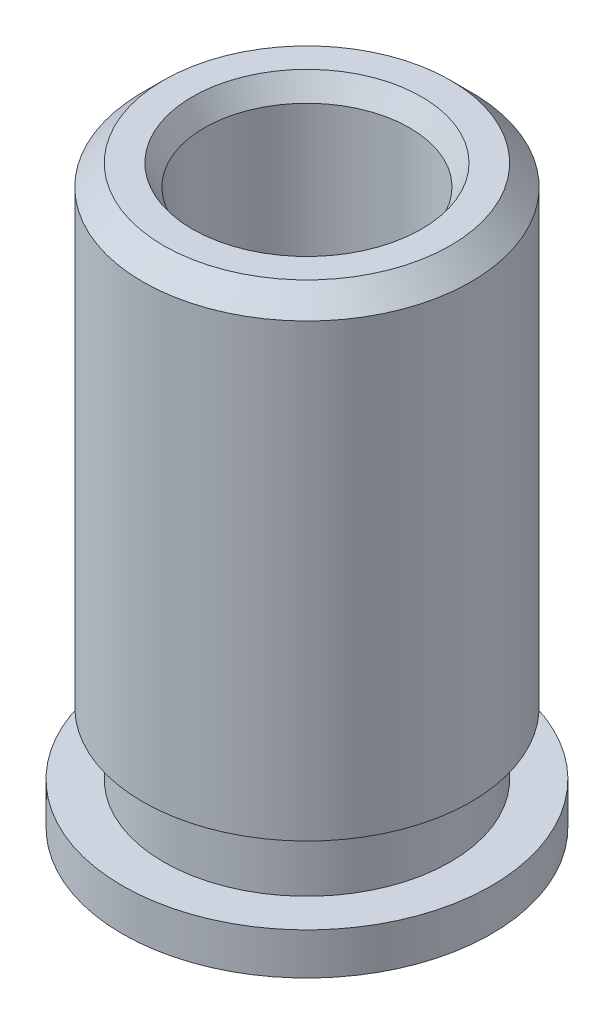
ISO-10303-21;
HEADER;
FILE_DESCRIPTION(('STEP AP214'),'2;1');
FILE_NAME('part.step','',(''),(''),'','','');
FILE_SCHEMA(('AUTOMOTIVE_DESIGN { 1 0 10303 214 1 1 1 1 }'));
ENDSEC;
DATA;
#1=APPLICATION_CONTEXT('core data for automotive mechanical design processes');
#2=APPLICATION_PROTOCOL_DEFINITION('international standard','automotive_design',2000,#1);
#3=PRODUCT_CONTEXT('',#1,'mechanical');
#4=PRODUCT('Part','Part','',(#3));
#5=PRODUCT_RELATED_PRODUCT_CATEGORY('part','',(#4));
#6=PRODUCT_DEFINITION_FORMATION('','',#4);
#7=PRODUCT_DEFINITION_CONTEXT('part definition',#1,'design');
#8=PRODUCT_DEFINITION('design','',#6,#7);
#9=PRODUCT_DEFINITION_SHAPE('','',#8);
#10=(LENGTH_UNIT() NAMED_UNIT(*) SI_UNIT(.MILLI.,.METRE.));
#11=(NAMED_UNIT(*) PLANE_ANGLE_UNIT() SI_UNIT($,.RADIAN.));
#12=(NAMED_UNIT(*) SI_UNIT($,.STERADIAN.) SOLID_ANGLE_UNIT());
#13=UNCERTAINTY_MEASURE_WITH_UNIT(LENGTH_MEASURE(1.E-05),#10,'distance_accuracy_value','');
#14=(GEOMETRIC_REPRESENTATION_CONTEXT(3) GLOBAL_UNCERTAINTY_ASSIGNED_CONTEXT((#13)) GLOBAL_UNIT_ASSIGNED_CONTEXT((#10,
#11,#12)) REPRESENTATION_CONTEXT('',''));
#15=CARTESIAN_POINT('',(0.,0.,0.));
#16=DIRECTION('',(0.,0.,1.));
#17=DIRECTION('',(1.,0.,0.));
#18=AXIS2_PLACEMENT_3D('',#15,#16,#17);
#19=CARTESIAN_POINT('',(0.,3.5052,0.));
#20=DIRECTION('',(0.,1.,0.));
#21=DIRECTION('',(0.,0.,1.));
#22=AXIS2_PLACEMENT_3D('',#19,#20,#21);
#23=CYLINDRICAL_SURFACE('',#22,2.2479);
#24=CARTESIAN_POINT('',(0.,-3.5052,0.));
#25=DIRECTION('',(0.,1.,0.));
#26=DIRECTION('',(0.,0.,1.));
#27=AXIS2_PLACEMENT_3D('',#24,#25,#26);
#28=CIRCLE('',#27,2.2479);
#29=CARTESIAN_POINT('',(0.,-3.5052,2.2479));
#30=VERTEX_POINT('',#29);
#31=EDGE_CURVE('E51',#30,#30,#28,.T.);
#32=ORIENTED_EDGE('',*,*,#31,.T.);
#33=EDGE_LOOP('',(#32));
#34=FACE_BOUND('',#33,.T.);
#35=CARTESIAN_POINT('',(0.,-2.9972,0.));
#36=DIRECTION('',(0.,1.,0.));
#37=DIRECTION('',(0.,0.,1.));
#38=AXIS2_PLACEMENT_3D('',#35,#36,#37);
#39=CIRCLE('',#38,2.2479);
#40=CARTESIAN_POINT('',(0.,-2.9972,2.2479));
#41=VERTEX_POINT('',#40);
#42=EDGE_CURVE('E9',#41,#41,#39,.T.);
#43=ORIENTED_EDGE('',*,*,#42,.F.);
#44=EDGE_LOOP('',(#43));
#45=FACE_BOUND('',#44,.T.);
#46=ADVANCED_FACE('F14',(#34,#45),#23,.T.);
#47=CARTESIAN_POINT('',(1.12395,-2.9972,0.));
#48=DIRECTION('',(0.,1.,0.));
#49=DIRECTION('',(0.,0.,1.));
#50=AXIS2_PLACEMENT_3D('',#47,#48,#49);
#51=PLANE('',#50);
#52=ORIENTED_EDGE('',*,*,#42,.T.);
#53=EDGE_LOOP('',(#52));
#54=FACE_BOUND('',#53,.T.);
#55=CARTESIAN_POINT('',(0.,-2.9972,0.));
#56=DIRECTION('',(0.,1.,0.));
#57=DIRECTION('',(0.,0.,1.));
#58=AXIS2_PLACEMENT_3D('',#55,#56,#57);
#59=CIRCLE('',#58,1.74625);
#60=CARTESIAN_POINT('',(0.,-2.9972,1.74625));
#61=VERTEX_POINT('',#60);
#62=EDGE_CURVE('E20',#61,#61,#59,.T.);
#63=ORIENTED_EDGE('',*,*,#62,.F.);
#64=EDGE_LOOP('',(#63));
#65=FACE_BOUND('',#64,.T.);
#66=ADVANCED_FACE('F77',(#54,#65),#51,.T.);
#67=CARTESIAN_POINT('',(0.,3.5052,0.));
#68=DIRECTION('',(0.,1.,0.));
#69=DIRECTION('',(0.,0.,1.));
#70=AXIS2_PLACEMENT_3D('',#67,#68,#69);
#71=CYLINDRICAL_SURFACE('',#70,1.74625);
#72=ORIENTED_EDGE('',*,*,#62,.T.);
#73=EDGE_LOOP('',(#72));
#74=FACE_BOUND('',#73,.T.);
#75=CARTESIAN_POINT('',(0.,-2.2352,0.));
#76=DIRECTION('',(0.,1.,0.));
#77=DIRECTION('',(0.,0.,1.));
#78=AXIS2_PLACEMENT_3D('',#75,#76,#77);
#79=CIRCLE('',#78,1.74625);
#80=CARTESIAN_POINT('',(0.,-2.2352,1.74625));
#81=VERTEX_POINT('',#80);
#82=EDGE_CURVE('E24',#81,#81,#79,.T.);
#83=ORIENTED_EDGE('',*,*,#82,.F.);
#84=EDGE_LOOP('',(#83));
#85=FACE_BOUND('',#84,.T.);
#86=ADVANCED_FACE('F82',(#74,#85),#71,.T.);
#87=CARTESIAN_POINT('',(1.12395,-2.2352,0.));
#88=DIRECTION('',(0.,-1.,0.));
#89=DIRECTION('',(0.,0.,-1.));
#90=AXIS2_PLACEMENT_3D('',#87,#88,#89);
#91=PLANE('',#90);
#92=ORIENTED_EDGE('',*,*,#82,.T.);
#93=EDGE_LOOP('',(#92));
#94=FACE_BOUND('',#93,.T.);
#95=CARTESIAN_POINT('',(0.,-2.2352,0.));
#96=DIRECTION('',(0.,1.,0.));
#97=DIRECTION('',(0.,0.,1.));
#98=AXIS2_PLACEMENT_3D('',#95,#96,#97);
#99=CIRCLE('',#98,2.00025);
#100=CARTESIAN_POINT('',(0.,-2.2352,2.00025));
#101=VERTEX_POINT('',#100);
#102=EDGE_CURVE('E28',#101,#101,#99,.T.);
#103=ORIENTED_EDGE('',*,*,#102,.F.);
#104=EDGE_LOOP('',(#103));
#105=FACE_BOUND('',#104,.T.);
#106=ADVANCED_FACE('F87',(#94,#105),#91,.T.);
#107=CARTESIAN_POINT('',(0.,3.5052,0.));
#108=DIRECTION('',(0.,1.,0.));
#109=DIRECTION('',(0.,0.,1.));
#110=AXIS2_PLACEMENT_3D('',#107,#108,#109);
#111=CYLINDRICAL_SURFACE('',#110,2.00025);
#112=ORIENTED_EDGE('',*,*,#102,.T.);
#113=EDGE_LOOP('',(#112));
#114=FACE_BOUND('',#113,.T.);
#115=CARTESIAN_POINT('',(0.,3.2512,0.));
#116=DIRECTION('',(0.,1.,0.));
#117=DIRECTION('',(0.,0.,1.));
#118=AXIS2_PLACEMENT_3D('',#115,#116,#117);
#119=CIRCLE('',#118,2.00025);
#120=CARTESIAN_POINT('',(0.,3.2512,2.00025));
#121=VERTEX_POINT('',#120);
#122=EDGE_CURVE('E33',#121,#121,#119,.T.);
#123=ORIENTED_EDGE('',*,*,#122,.F.);
#124=EDGE_LOOP('',(#123));
#125=FACE_BOUND('',#124,.T.);
#126=ADVANCED_FACE('F93',(#114,#125),#111,.T.);
#127=CARTESIAN_POINT('',(0.,3.5052,0.));
#128=DIRECTION('',(0.,-1.,0.));
#129=DIRECTION('',(0.,0.,-1.));
#130=AXIS2_PLACEMENT_3D('',#127,#128,#129);
#131=CONICAL_SURFACE('',#130,1.74625,0.785398163397446);
#132=ORIENTED_EDGE('',*,*,#122,.T.);
#133=EDGE_LOOP('',(#132));
#134=FACE_BOUND('',#133,.T.);
#135=CARTESIAN_POINT('',(0.,3.5052,0.));
#136=DIRECTION('',(0.,1.,0.));
#137=DIRECTION('',(0.,0.,1.));
#138=AXIS2_PLACEMENT_3D('',#135,#136,#137);
#139=CIRCLE('',#138,1.74625);
#140=CARTESIAN_POINT('',(0.,3.5052,1.74625));
#141=VERTEX_POINT('',#140);
#142=EDGE_CURVE('E36',#141,#141,#139,.T.);
#143=ORIENTED_EDGE('',*,*,#142,.F.);
#144=EDGE_LOOP('',(#143));
#145=FACE_BOUND('',#144,.T.);
#146=ADVANCED_FACE('F97',(#134,#145),#131,.T.);
#147=CARTESIAN_POINT('',(1.12395,3.5052,0.));
#148=DIRECTION('',(0.,1.,0.));
#149=DIRECTION('',(0.,0.,1.));
#150=AXIS2_PLACEMENT_3D('',#147,#148,#149);
#151=PLANE('',#150);
#152=ORIENTED_EDGE('',*,*,#142,.T.);
#153=EDGE_LOOP('',(#152));
#154=FACE_BOUND('',#153,.T.);
#155=CARTESIAN_POINT('',(0.,3.5052,0.));
#156=DIRECTION('',(0.,1.,0.));
#157=DIRECTION('',(0.,0.,1.));
#158=AXIS2_PLACEMENT_3D('',#155,#156,#157);
#159=CIRCLE('',#158,1.39664696837416);
#160=CARTESIAN_POINT('',(0.,3.5052,1.39664696837416));
#161=VERTEX_POINT('',#160);
#162=EDGE_CURVE('E39',#161,#161,#159,.T.);
#163=ORIENTED_EDGE('',*,*,#162,.F.);
#164=EDGE_LOOP('',(#163));
#165=FACE_BOUND('',#164,.T.);
#166=ADVANCED_FACE('F101',(#154,#165),#151,.T.);
#167=CARTESIAN_POINT('',(0.,3.2512,0.));
#168=DIRECTION('',(0.,1.,0.));
#169=DIRECTION('',(0.,0.,1.));
#170=AXIS2_PLACEMENT_3D('',#167,#168,#169);
#171=CONICAL_SURFACE('',#170,1.25,0.5235987755983);
#172=ORIENTED_EDGE('',*,*,#162,.T.);
#173=EDGE_LOOP('',(#172));
#174=FACE_BOUND('',#173,.T.);
#175=CARTESIAN_POINT('',(0.,3.2512,0.));
#176=DIRECTION('',(0.,1.,0.));
#177=DIRECTION('',(0.,0.,1.));
#178=AXIS2_PLACEMENT_3D('',#175,#176,#177);
#179=CIRCLE('',#178,1.25);
#180=CARTESIAN_POINT('',(0.,3.2512,1.25));
#181=VERTEX_POINT('',#180);
#182=EDGE_CURVE('E42',#181,#181,#179,.T.);
#183=ORIENTED_EDGE('',*,*,#182,.F.);
#184=EDGE_LOOP('',(#183));
#185=FACE_BOUND('',#184,.T.);
#186=ADVANCED_FACE('F73',(#174,#185),#171,.F.);
#187=CARTESIAN_POINT('',(0.,3.5052,0.));
#188=DIRECTION('',(0.,1.,0.));
#189=DIRECTION('',(0.,0.,1.));
#190=AXIS2_PLACEMENT_3D('',#187,#188,#189);
#191=CYLINDRICAL_SURFACE('',#190,1.25);
#192=ORIENTED_EDGE('',*,*,#182,.T.);
#193=EDGE_LOOP('',(#192));
#194=FACE_BOUND('',#193,.T.);
#195=CARTESIAN_POINT('',(0.,-3.2512,0.));
#196=DIRECTION('',(0.,1.,0.));
#197=DIRECTION('',(0.,0.,1.));
#198=AXIS2_PLACEMENT_3D('',#195,#196,#197);
#199=CIRCLE('',#198,1.25);
#200=CARTESIAN_POINT('',(0.,-3.2512,1.25));
#201=VERTEX_POINT('',#200);
#202=EDGE_CURVE('E45',#201,#201,#199,.T.);
#203=ORIENTED_EDGE('',*,*,#202,.F.);
#204=EDGE_LOOP('',(#203));
#205=FACE_BOUND('',#204,.T.);
#206=ADVANCED_FACE('F65',(#194,#205),#191,.F.);
#207=CARTESIAN_POINT('',(0.,-3.5052,0.));
#208=DIRECTION('',(0.,-1.,0.));
#209=DIRECTION('',(0.,0.,-1.));
#210=AXIS2_PLACEMENT_3D('',#207,#208,#209);
#211=CONICAL_SURFACE('',#210,1.39664696837416,0.523598775598301);
#212=ORIENTED_EDGE('',*,*,#202,.T.);
#213=EDGE_LOOP('',(#212));
#214=FACE_BOUND('',#213,.T.);
#215=CARTESIAN_POINT('',(0.,-3.5052,0.));
#216=DIRECTION('',(0.,1.,0.));
#217=DIRECTION('',(0.,0.,1.));
#218=AXIS2_PLACEMENT_3D('',#215,#216,#217);
#219=CIRCLE('',#218,1.39664696837416);
#220=CARTESIAN_POINT('',(0.,-3.5052,1.39664696837416));
#221=VERTEX_POINT('',#220);
#222=EDGE_CURVE('E48',#221,#221,#219,.T.);
#223=ORIENTED_EDGE('',*,*,#222,.F.);
#224=EDGE_LOOP('',(#223));
#225=FACE_BOUND('',#224,.T.);
#226=ADVANCED_FACE('F60',(#214,#225),#211,.F.);
#227=CARTESIAN_POINT('',(1.12395,-3.5052,0.));
#228=DIRECTION('',(0.,1.,0.));
#229=DIRECTION('',(0.,0.,1.));
#230=AXIS2_PLACEMENT_3D('',#227,#228,#229);
#231=PLANE('',#230);
#232=ORIENTED_EDGE('',*,*,#31,.F.);
#233=EDGE_LOOP('',(#232));
#234=FACE_BOUND('',#233,.T.);
#235=ORIENTED_EDGE('',*,*,#222,.T.);
#236=EDGE_LOOP('',(#235));
#237=FACE_BOUND('',#236,.T.);
#238=ADVANCED_FACE('F57',(#234,#237),#231,.F.);
#239=CLOSED_SHELL('',(#46,#66,#86,#106,#126,#146,#166,#186,#206,#226,#238));
#240=MANIFOLD_SOLID_BREP('B1',#239);
#241=ADVANCED_BREP_SHAPE_REPRESENTATION('',(#18,#240),#14);
#242=SHAPE_DEFINITION_REPRESENTATION(#9,#241);
ENDSEC;
END-ISO-10303-21;
